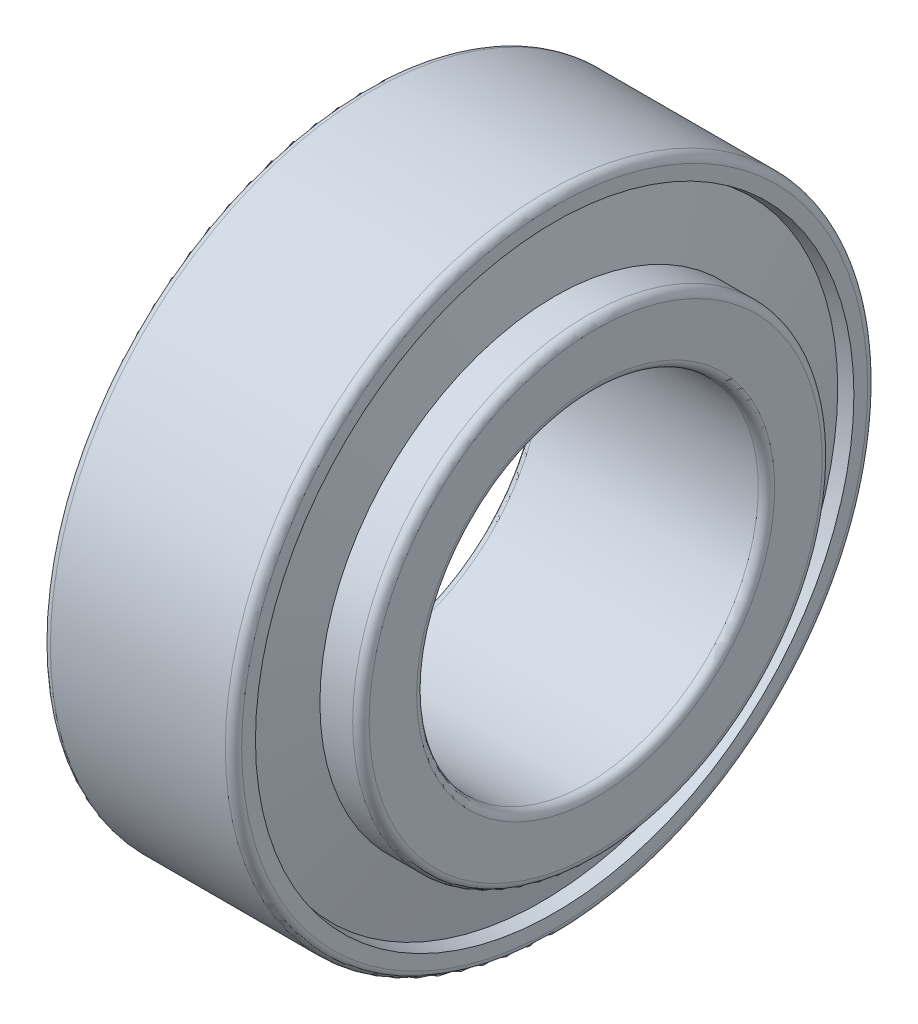
ISO-10303-21;
HEADER;
FILE_DESCRIPTION(('STEP AP214'),'2;1');
FILE_NAME('part.step','',(''),(''),'','','');
FILE_SCHEMA(('AUTOMOTIVE_DESIGN { 1 0 10303 214 1 1 1 1 }'));
ENDSEC;
DATA;
#1=APPLICATION_CONTEXT('core data for automotive mechanical design processes');
#2=APPLICATION_PROTOCOL_DEFINITION('international standard','automotive_design',2000,#1);
#3=PRODUCT_CONTEXT('',#1,'mechanical');
#4=PRODUCT('Part','Part','',(#3));
#5=PRODUCT_RELATED_PRODUCT_CATEGORY('part','',(#4));
#6=PRODUCT_DEFINITION_FORMATION('','',#4);
#7=PRODUCT_DEFINITION_CONTEXT('part definition',#1,'design');
#8=PRODUCT_DEFINITION('design','',#6,#7);
#9=PRODUCT_DEFINITION_SHAPE('','',#8);
#10=(LENGTH_UNIT() NAMED_UNIT(*) SI_UNIT(.MILLI.,.METRE.));
#11=(NAMED_UNIT(*) PLANE_ANGLE_UNIT() SI_UNIT($,.RADIAN.));
#12=(NAMED_UNIT(*) SI_UNIT($,.STERADIAN.) SOLID_ANGLE_UNIT());
#13=UNCERTAINTY_MEASURE_WITH_UNIT(LENGTH_MEASURE(1.E-05),#10,'distance_accuracy_value','');
#14=(GEOMETRIC_REPRESENTATION_CONTEXT(3) GLOBAL_UNCERTAINTY_ASSIGNED_CONTEXT((#13)) GLOBAL_UNIT_ASSIGNED_CONTEXT((#10,
#11,#12)) REPRESENTATION_CONTEXT('',''));
#15=CARTESIAN_POINT('',(0.,0.,0.));
#16=DIRECTION('',(0.,0.,1.));
#17=DIRECTION('',(1.,0.,0.));
#18=AXIS2_PLACEMENT_3D('',#15,#16,#17);
#19=CARTESIAN_POINT('',(0.970205182824535,0.,0.));
#20=DIRECTION('',(-1.,0.,0.));
#21=DIRECTION('',(0.,0.,1.));
#22=AXIS2_PLACEMENT_3D('',#19,#20,#21);
#23=CONICAL_SURFACE('',#22,19.3298873800172,1.38026455011886);
#24=CARTESIAN_POINT('',(1.94041036564896,0.,0.));
#25=DIRECTION('',(-1.,0.,0.));
#26=DIRECTION('',(0.,0.,1.));
#27=AXIS2_PLACEMENT_3D('',#24,#25,#26);
#28=CIRCLE('',#27,14.2995641318725);
#29=CARTESIAN_POINT('',(1.94041036564896,0.,14.2995641318725));
#30=VERTEX_POINT('',#29);
#31=EDGE_CURVE('E112',#30,#30,#28,.T.);
#32=ORIENTED_EDGE('',*,*,#31,.F.);
#33=EDGE_LOOP('',(#32));
#34=FACE_BOUND('',#33,.T.);
#35=CARTESIAN_POINT('',(0.970205182824535,0.,0.));
#36=DIRECTION('',(-1.,0.,0.));
#37=DIRECTION('',(0.,0.,1.));
#38=AXIS2_PLACEMENT_3D('',#35,#36,#37);
#39=CIRCLE('',#38,19.3298873800172);
#40=CARTESIAN_POINT('',(0.970205182824535,0.,19.3298873800172));
#41=VERTEX_POINT('',#40);
#42=EDGE_CURVE('E10',#41,#41,#39,.T.);
#43=ORIENTED_EDGE('',*,*,#42,.T.);
#44=EDGE_LOOP('',(#43));
#45=FACE_BOUND('',#44,.T.);
#46=ADVANCED_FACE('F37',(#34,#45),#23,.F.);
#47=CARTESIAN_POINT('',(0.,0.,0.));
#48=DIRECTION('',(1.,0.,0.));
#49=DIRECTION('',(0.,0.,-1.));
#50=AXIS2_PLACEMENT_3D('',#47,#48,#49);
#51=CONICAL_SURFACE('',#50,19.139,0.194268129763412);
#52=ORIENTED_EDGE('',*,*,#42,.F.);
#53=EDGE_LOOP('',(#52));
#54=FACE_BOUND('',#53,.T.);
#55=CARTESIAN_POINT('',(0.,0.,0.));
#56=DIRECTION('',(-1.,0.,0.));
#57=DIRECTION('',(0.,0.,1.));
#58=AXIS2_PLACEMENT_3D('',#55,#56,#57);
#59=CIRCLE('',#58,19.139);
#60=CARTESIAN_POINT('',(0.,0.,19.139));
#61=VERTEX_POINT('',#60);
#62=EDGE_CURVE('E44',#61,#61,#59,.T.);
#63=ORIENTED_EDGE('',*,*,#62,.T.);
#64=EDGE_LOOP('',(#63));
#65=FACE_BOUND('',#64,.T.);
#66=ADVANCED_FACE('F120',(#54,#65),#51,.F.);
#67=CARTESIAN_POINT('',(0.,19.139,0.));
#68=DIRECTION('',(1.,0.,0.));
#69=DIRECTION('',(0.,0.,-1.));
#70=AXIS2_PLACEMENT_3D('',#67,#68,#69);
#71=PLANE('',#70);
#72=ORIENTED_EDGE('',*,*,#62,.F.);
#73=EDGE_LOOP('',(#72));
#74=FACE_BOUND('',#73,.T.);
#75=CARTESIAN_POINT('',(0.,0.,0.));
#76=DIRECTION('',(-1.,0.,0.));
#77=DIRECTION('',(0.,0.,1.));
#78=AXIS2_PLACEMENT_3D('',#75,#76,#77);
#79=CIRCLE('',#78,22.9);
#80=CARTESIAN_POINT('',(0.,0.,22.9));
#81=VERTEX_POINT('',#80);
#82=EDGE_CURVE('E49',#81,#81,#79,.T.);
#83=ORIENTED_EDGE('',*,*,#82,.T.);
#84=EDGE_LOOP('',(#83));
#85=FACE_BOUND('',#84,.T.);
#86=ADVANCED_FACE('F124',(#74,#85),#71,.F.);
#87=CARTESIAN_POINT('',(0.6,0.,0.));
#88=DIRECTION('',(-1.,0.,0.));
#89=DIRECTION('',(0.,0.,1.));
#90=AXIS2_PLACEMENT_3D('',#87,#88,#89);
#91=TOROIDAL_SURFACE('',#90,22.9,0.600000000000002);
#92=ORIENTED_EDGE('',*,*,#82,.F.);
#93=EDGE_LOOP('',(#92));
#94=FACE_BOUND('',#93,.T.);
#95=CARTESIAN_POINT('',(0.600000000000045,0.,0.));
#96=DIRECTION('',(-1.,0.,0.));
#97=DIRECTION('',(0.,0.,1.));
#98=AXIS2_PLACEMENT_3D('',#95,#96,#97);
#99=CIRCLE('',#98,23.5);
#100=CARTESIAN_POINT('',(0.600000000000045,0.,23.5));
#101=VERTEX_POINT('',#100);
#102=EDGE_CURVE('E54',#101,#101,#99,.T.);
#103=ORIENTED_EDGE('',*,*,#102,.T.);
#104=EDGE_LOOP('',(#103));
#105=FACE_BOUND('',#104,.T.);
#106=ADVANCED_FACE('F129',(#94,#105),#91,.T.);
#107=CARTESIAN_POINT('',(-882.527700014444,0.,0.));
#108=DIRECTION('',(-1.,0.,0.));
#109=DIRECTION('',(0.,0.,1.));
#110=AXIS2_PLACEMENT_3D('',#107,#108,#109);
#111=CYLINDRICAL_SURFACE('',#110,23.5);
#112=ORIENTED_EDGE('',*,*,#102,.F.);
#113=EDGE_LOOP('',(#112));
#114=FACE_BOUND('',#113,.T.);
#115=CARTESIAN_POINT('',(13.4,0.,0.));
#116=DIRECTION('',(-1.,0.,0.));
#117=DIRECTION('',(0.,0.,1.));
#118=AXIS2_PLACEMENT_3D('',#115,#116,#117);
#119=CIRCLE('',#118,23.5);
#120=CARTESIAN_POINT('',(13.4,0.,23.5));
#121=VERTEX_POINT('',#120);
#122=EDGE_CURVE('E60',#121,#121,#119,.T.);
#123=ORIENTED_EDGE('',*,*,#122,.T.);
#124=EDGE_LOOP('',(#123));
#125=FACE_BOUND('',#124,.T.);
#126=ADVANCED_FACE('F135',(#114,#125),#111,.T.);
#127=CARTESIAN_POINT('',(13.4,0.,0.));
#128=DIRECTION('',(-1.,0.,0.));
#129=DIRECTION('',(0.,0.,1.));
#130=AXIS2_PLACEMENT_3D('',#127,#128,#129);
#131=TOROIDAL_SURFACE('',#130,22.9,0.600000000000002);
#132=ORIENTED_EDGE('',*,*,#122,.F.);
#133=EDGE_LOOP('',(#132));
#134=FACE_BOUND('',#133,.T.);
#135=CARTESIAN_POINT('',(14.,0.,0.));
#136=DIRECTION('',(-1.,0.,0.));
#137=DIRECTION('',(0.,0.,1.));
#138=AXIS2_PLACEMENT_3D('',#135,#136,#137);
#139=CIRCLE('',#138,22.9);
#140=CARTESIAN_POINT('',(14.,0.,22.9));
#141=VERTEX_POINT('',#140);
#142=EDGE_CURVE('E64',#141,#141,#139,.T.);
#143=ORIENTED_EDGE('',*,*,#142,.T.);
#144=EDGE_LOOP('',(#143));
#145=FACE_BOUND('',#144,.T.);
#146=ADVANCED_FACE('F139',(#134,#145),#131,.T.);
#147=CARTESIAN_POINT('',(14.,22.9,0.));
#148=DIRECTION('',(-1.,0.,0.));
#149=DIRECTION('',(0.,0.,1.));
#150=AXIS2_PLACEMENT_3D('',#147,#148,#149);
#151=PLANE('',#150);
#152=ORIENTED_EDGE('',*,*,#142,.F.);
#153=EDGE_LOOP('',(#152));
#154=FACE_BOUND('',#153,.T.);
#155=CARTESIAN_POINT('',(14.,0.,0.));
#156=DIRECTION('',(-1.,0.,0.));
#157=DIRECTION('',(0.,0.,1.));
#158=AXIS2_PLACEMENT_3D('',#155,#156,#157);
#159=CIRCLE('',#158,21.893492933609);
#160=CARTESIAN_POINT('',(14.,0.,21.893492933609));
#161=VERTEX_POINT('',#160);
#162=EDGE_CURVE('E68',#161,#161,#159,.T.);
#163=ORIENTED_EDGE('',*,*,#162,.T.);
#164=EDGE_LOOP('',(#163));
#165=FACE_BOUND('',#164,.T.);
#166=ADVANCED_FACE('F143',(#154,#165),#151,.F.);
#167=CARTESIAN_POINT('',(13.0124261178559,0.,0.));
#168=DIRECTION('',(1.,0.,0.));
#169=DIRECTION('',(0.,0.,-1.));
#170=AXIS2_PLACEMENT_3D('',#167,#168,#169);
#171=CONICAL_SURFACE('',#170,21.6991882707673,0.194268129763411);
#172=ORIENTED_EDGE('',*,*,#162,.F.);
#173=EDGE_LOOP('',(#172));
#174=FACE_BOUND('',#173,.T.);
#175=CARTESIAN_POINT('',(13.0124261178559,0.,0.));
#176=DIRECTION('',(-1.,0.,0.));
#177=DIRECTION('',(0.,0.,1.));
#178=AXIS2_PLACEMENT_3D('',#175,#176,#177);
#179=CIRCLE('',#178,21.6991882707673);
#180=CARTESIAN_POINT('',(13.0124261178559,0.,21.6991882707673));
#181=VERTEX_POINT('',#180);
#182=EDGE_CURVE('E72',#181,#181,#179,.T.);
#183=ORIENTED_EDGE('',*,*,#182,.T.);
#184=EDGE_LOOP('',(#183));
#185=FACE_BOUND('',#184,.T.);
#186=ADVANCED_FACE('F147',(#174,#185),#171,.F.);
#187=CARTESIAN_POINT('',(14.,0.,0.));
#188=DIRECTION('',(-1.,0.,0.));
#189=DIRECTION('',(0.,0.,1.));
#190=AXIS2_PLACEMENT_3D('',#187,#188,#189);
#191=CONICAL_SURFACE('',#190,16.5788117292326,1.38026455011885);
#192=ORIENTED_EDGE('',*,*,#182,.F.);
#193=EDGE_LOOP('',(#192));
#194=FACE_BOUND('',#193,.T.);
#195=CARTESIAN_POINT('',(14.,0.,0.));
#196=DIRECTION('',(-1.,0.,0.));
#197=DIRECTION('',(0.,0.,1.));
#198=AXIS2_PLACEMENT_3D('',#195,#196,#197);
#199=CIRCLE('',#198,16.5788117292326);
#200=CARTESIAN_POINT('',(14.,0.,16.5788117292326));
#201=VERTEX_POINT('',#200);
#202=EDGE_CURVE('E76',#201,#201,#199,.T.);
#203=ORIENTED_EDGE('',*,*,#202,.T.);
#204=EDGE_LOOP('',(#203));
#205=FACE_BOUND('',#204,.T.);
#206=ADVANCED_FACE('F151',(#194,#205),#191,.T.);
#207=CARTESIAN_POINT('',(14.,17.1788117292326,0.));
#208=DIRECTION('',(1.,0.,0.));
#209=DIRECTION('',(0.,0.,-1.));
#210=AXIS2_PLACEMENT_3D('',#207,#208,#209);
#211=PLANE('',#210);
#212=ORIENTED_EDGE('',*,*,#202,.F.);
#213=EDGE_LOOP('',(#212));
#214=FACE_BOUND('',#213,.T.);
#215=CARTESIAN_POINT('',(14.,0.,0.));
#216=DIRECTION('',(-1.,0.,0.));
#217=DIRECTION('',(0.,0.,1.));
#218=AXIS2_PLACEMENT_3D('',#215,#216,#217);
#219=CIRCLE('',#218,17.1788117292326);
#220=CARTESIAN_POINT('',(14.,0.,17.1788117292326));
#221=VERTEX_POINT('',#220);
#222=EDGE_CURVE('E80',#221,#221,#219,.T.);
#223=ORIENTED_EDGE('',*,*,#222,.T.);
#224=EDGE_LOOP('',(#223));
#225=FACE_BOUND('',#224,.T.);
#226=ADVANCED_FACE('F155',(#214,#225),#211,.F.);
#227=CARTESIAN_POINT('',(-882.527700014444,0.,0.));
#228=DIRECTION('',(-1.,0.,0.));
#229=DIRECTION('',(0.,0.,1.));
#230=AXIS2_PLACEMENT_3D('',#227,#228,#229);
#231=CYLINDRICAL_SURFACE('',#230,17.1788117292326);
#232=ORIENTED_EDGE('',*,*,#222,.F.);
#233=EDGE_LOOP('',(#232));
#234=FACE_BOUND('',#233,.T.);
#235=CARTESIAN_POINT('',(16.4,0.,0.));
#236=DIRECTION('',(-1.,0.,0.));
#237=DIRECTION('',(0.,0.,1.));
#238=AXIS2_PLACEMENT_3D('',#235,#236,#237);
#239=CIRCLE('',#238,17.1788117292326);
#240=CARTESIAN_POINT('',(16.4,0.,17.1788117292326));
#241=VERTEX_POINT('',#240);
#242=EDGE_CURVE('E84',#241,#241,#239,.T.);
#243=ORIENTED_EDGE('',*,*,#242,.T.);
#244=EDGE_LOOP('',(#243));
#245=FACE_BOUND('',#244,.T.);
#246=ADVANCED_FACE('F159',(#234,#245),#231,.T.);
#247=CARTESIAN_POINT('',(16.4,0.,0.));
#248=DIRECTION('',(-1.,0.,0.));
#249=DIRECTION('',(0.,0.,1.));
#250=AXIS2_PLACEMENT_3D('',#247,#248,#249);
#251=TOROIDAL_SURFACE('',#250,16.5788117292326,0.600000000000003);
#252=ORIENTED_EDGE('',*,*,#242,.F.);
#253=EDGE_LOOP('',(#252));
#254=FACE_BOUND('',#253,.T.);
#255=CARTESIAN_POINT('',(17.,0.,0.));
#256=DIRECTION('',(-1.,0.,0.));
#257=DIRECTION('',(0.,0.,1.));
#258=AXIS2_PLACEMENT_3D('',#255,#256,#257);
#259=CIRCLE('',#258,16.5788117292326);
#260=CARTESIAN_POINT('',(17.,0.,16.5788117292326));
#261=VERTEX_POINT('',#260);
#262=EDGE_CURVE('E88',#261,#261,#259,.T.);
#263=ORIENTED_EDGE('',*,*,#262,.T.);
#264=EDGE_LOOP('',(#263));
#265=FACE_BOUND('',#264,.T.);
#266=ADVANCED_FACE('F163',(#254,#265),#251,.T.);
#267=CARTESIAN_POINT('',(17.,13.1,0.));
#268=DIRECTION('',(-1.,0.,0.));
#269=DIRECTION('',(0.,0.,1.));
#270=AXIS2_PLACEMENT_3D('',#267,#268,#269);
#271=PLANE('',#270);
#272=ORIENTED_EDGE('',*,*,#262,.F.);
#273=EDGE_LOOP('',(#272));
#274=FACE_BOUND('',#273,.T.);
#275=CARTESIAN_POINT('',(17.,0.,0.));
#276=DIRECTION('',(-1.,0.,0.));
#277=DIRECTION('',(0.,0.,1.));
#278=AXIS2_PLACEMENT_3D('',#275,#276,#277);
#279=CIRCLE('',#278,13.1);
#280=CARTESIAN_POINT('',(17.,0.,13.1));
#281=VERTEX_POINT('',#280);
#282=EDGE_CURVE('E92',#281,#281,#279,.T.);
#283=ORIENTED_EDGE('',*,*,#282,.T.);
#284=EDGE_LOOP('',(#283));
#285=FACE_BOUND('',#284,.T.);
#286=ADVANCED_FACE('F167',(#274,#285),#271,.F.);
#287=CARTESIAN_POINT('',(16.4,0.,0.));
#288=DIRECTION('',(-1.,0.,0.));
#289=DIRECTION('',(0.,0.,1.));
#290=AXIS2_PLACEMENT_3D('',#287,#288,#289);
#291=TOROIDAL_SURFACE('',#290,13.1,0.600000000000003);
#292=ORIENTED_EDGE('',*,*,#282,.F.);
#293=EDGE_LOOP('',(#292));
#294=FACE_BOUND('',#293,.T.);
#295=CARTESIAN_POINT('',(16.4,0.,0.));
#296=DIRECTION('',(-1.,0.,0.));
#297=DIRECTION('',(0.,0.,1.));
#298=AXIS2_PLACEMENT_3D('',#295,#296,#297);
#299=CIRCLE('',#298,12.5);
#300=CARTESIAN_POINT('',(16.4,0.,12.5));
#301=VERTEX_POINT('',#300);
#302=EDGE_CURVE('E96',#301,#301,#299,.T.);
#303=ORIENTED_EDGE('',*,*,#302,.T.);
#304=EDGE_LOOP('',(#303));
#305=FACE_BOUND('',#304,.T.);
#306=ADVANCED_FACE('F171',(#294,#305),#291,.T.);
#307=CARTESIAN_POINT('',(-882.527700014444,0.,0.));
#308=DIRECTION('',(-1.,0.,0.));
#309=DIRECTION('',(0.,0.,1.));
#310=AXIS2_PLACEMENT_3D('',#307,#308,#309);
#311=CYLINDRICAL_SURFACE('',#310,12.5);
#312=ORIENTED_EDGE('',*,*,#302,.F.);
#313=EDGE_LOOP('',(#312));
#314=FACE_BOUND('',#313,.T.);
#315=CARTESIAN_POINT('',(0.600000000000045,0.,0.));
#316=DIRECTION('',(-1.,0.,0.));
#317=DIRECTION('',(0.,0.,1.));
#318=AXIS2_PLACEMENT_3D('',#315,#316,#317);
#319=CIRCLE('',#318,12.5);
#320=CARTESIAN_POINT('',(0.600000000000045,0.,12.5));
#321=VERTEX_POINT('',#320);
#322=EDGE_CURVE('E100',#321,#321,#319,.T.);
#323=ORIENTED_EDGE('',*,*,#322,.T.);
#324=EDGE_LOOP('',(#323));
#325=FACE_BOUND('',#324,.T.);
#326=ADVANCED_FACE('F175',(#314,#325),#311,.F.);
#327=CARTESIAN_POINT('',(0.6,0.,0.));
#328=DIRECTION('',(-1.,0.,0.));
#329=DIRECTION('',(0.,0.,1.));
#330=AXIS2_PLACEMENT_3D('',#327,#328,#329);
#331=TOROIDAL_SURFACE('',#330,13.1,0.600000000000002);
#332=ORIENTED_EDGE('',*,*,#322,.F.);
#333=EDGE_LOOP('',(#332));
#334=FACE_BOUND('',#333,.T.);
#335=CARTESIAN_POINT('',(0.,0.,0.));
#336=DIRECTION('',(-1.,0.,0.));
#337=DIRECTION('',(0.,0.,1.));
#338=AXIS2_PLACEMENT_3D('',#335,#336,#337);
#339=CIRCLE('',#338,13.1);
#340=CARTESIAN_POINT('',(0.,0.,13.1));
#341=VERTEX_POINT('',#340);
#342=EDGE_CURVE('E104',#341,#341,#339,.T.);
#343=ORIENTED_EDGE('',*,*,#342,.T.);
#344=EDGE_LOOP('',(#343));
#345=FACE_BOUND('',#344,.T.);
#346=ADVANCED_FACE('F179',(#334,#345),#331,.T.);
#347=CARTESIAN_POINT('',(0.,14.2995641318725,0.));
#348=DIRECTION('',(1.,0.,0.));
#349=DIRECTION('',(0.,0.,-1.));
#350=AXIS2_PLACEMENT_3D('',#347,#348,#349);
#351=PLANE('',#350);
#352=ORIENTED_EDGE('',*,*,#342,.F.);
#353=EDGE_LOOP('',(#352));
#354=FACE_BOUND('',#353,.T.);
#355=CARTESIAN_POINT('',(0.,0.,0.));
#356=DIRECTION('',(-1.,0.,0.));
#357=DIRECTION('',(0.,0.,1.));
#358=AXIS2_PLACEMENT_3D('',#355,#356,#357);
#359=CIRCLE('',#358,14.2995641318725);
#360=CARTESIAN_POINT('',(0.,0.,14.2995641318725));
#361=VERTEX_POINT('',#360);
#362=EDGE_CURVE('E108',#361,#361,#359,.T.);
#363=ORIENTED_EDGE('',*,*,#362,.T.);
#364=EDGE_LOOP('',(#363));
#365=FACE_BOUND('',#364,.T.);
#366=ADVANCED_FACE('F183',(#354,#365),#351,.F.);
#367=CARTESIAN_POINT('',(-882.527700014444,0.,0.));
#368=DIRECTION('',(-1.,0.,0.));
#369=DIRECTION('',(0.,0.,1.));
#370=AXIS2_PLACEMENT_3D('',#367,#368,#369);
#371=CYLINDRICAL_SURFACE('',#370,14.2995641318725);
#372=ORIENTED_EDGE('',*,*,#362,.F.);
#373=EDGE_LOOP('',(#372));
#374=FACE_BOUND('',#373,.T.);
#375=ORIENTED_EDGE('',*,*,#31,.T.);
#376=EDGE_LOOP('',(#375));
#377=FACE_BOUND('',#376,.T.);
#378=ADVANCED_FACE('F117',(#374,#377),#371,.T.);
#379=CLOSED_SHELL('',(#46,#66,#86,#106,#126,#146,#166,#186,#206,#226,#246,#266,#286,#306,#326,
#346,#366,#378));
#380=MANIFOLD_SOLID_BREP('B2',#379);
#381=ADVANCED_BREP_SHAPE_REPRESENTATION('',(#18,#380),#14);
#382=SHAPE_DEFINITION_REPRESENTATION(#9,#381);
ENDSEC;
END-ISO-10303-21;
